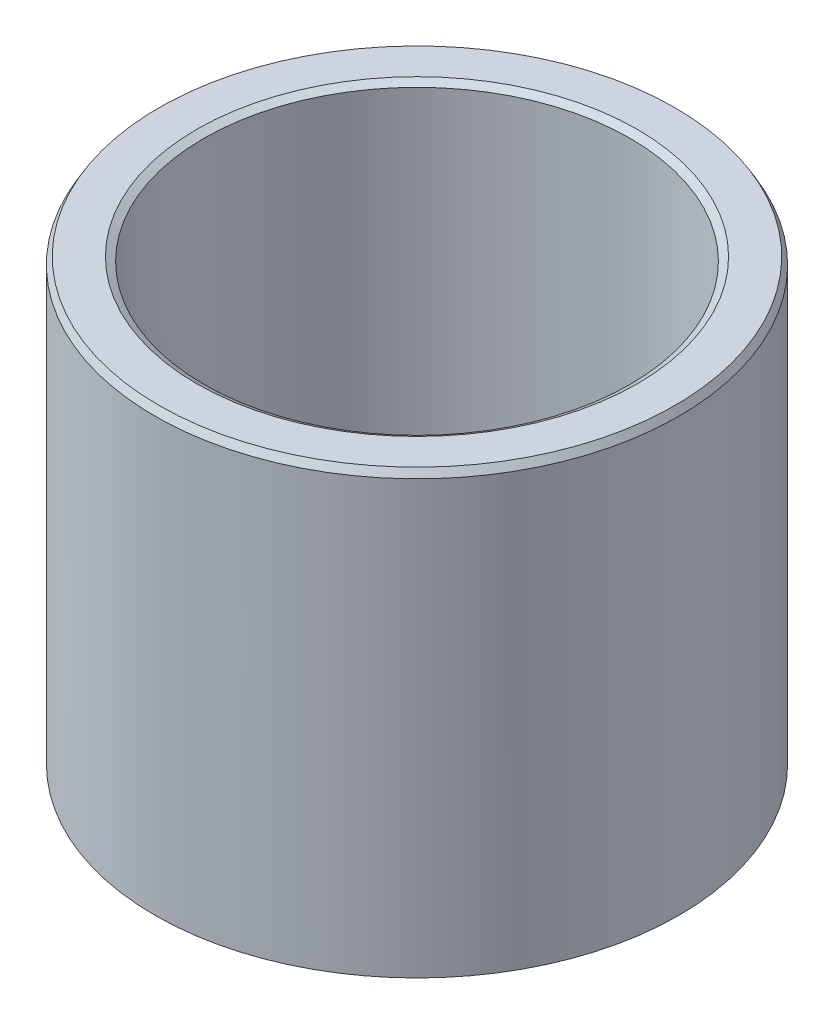
ISO-10303-21;
HEADER;
FILE_DESCRIPTION(('STEP AP214'),'2;1');
FILE_NAME('part.step','',(''),(''),'','','');
FILE_SCHEMA(('AUTOMOTIVE_DESIGN { 1 0 10303 214 1 1 1 1 }'));
ENDSEC;
DATA;
#1=APPLICATION_CONTEXT('core data for automotive mechanical design processes');
#2=APPLICATION_PROTOCOL_DEFINITION('international standard','automotive_design',2000,#1);
#3=PRODUCT_CONTEXT('',#1,'mechanical');
#4=PRODUCT('Part','Part','',(#3));
#5=PRODUCT_RELATED_PRODUCT_CATEGORY('part','',(#4));
#6=PRODUCT_DEFINITION_FORMATION('','',#4);
#7=PRODUCT_DEFINITION_CONTEXT('part definition',#1,'design');
#8=PRODUCT_DEFINITION('design','',#6,#7);
#9=PRODUCT_DEFINITION_SHAPE('','',#8);
#10=(LENGTH_UNIT() NAMED_UNIT(*) SI_UNIT(.MILLI.,.METRE.));
#11=(NAMED_UNIT(*) PLANE_ANGLE_UNIT() SI_UNIT($,.RADIAN.));
#12=(NAMED_UNIT(*) SI_UNIT($,.STERADIAN.) SOLID_ANGLE_UNIT());
#13=UNCERTAINTY_MEASURE_WITH_UNIT(LENGTH_MEASURE(1.E-05),#10,'distance_accuracy_value','');
#14=(GEOMETRIC_REPRESENTATION_CONTEXT(3) GLOBAL_UNCERTAINTY_ASSIGNED_CONTEXT((#13)) GLOBAL_UNIT_ASSIGNED_CONTEXT((#10,
#11,#12)) REPRESENTATION_CONTEXT('',''));
#15=CARTESIAN_POINT('',(0.,0.,0.));
#16=DIRECTION('',(0.,0.,1.));
#17=DIRECTION('',(1.,0.,0.));
#18=AXIS2_PLACEMENT_3D('',#15,#16,#17);
#19=CARTESIAN_POINT('',(0.,80.4044867782708,0.));
#20=DIRECTION('',(0.,-1.,0.));
#21=DIRECTION('',(0.,0.,-1.));
#22=AXIS2_PLACEMENT_3D('',#19,#20,#21);
#23=CYLINDRICAL_SURFACE('',#22,47.5);
#24=CARTESIAN_POINT('',(0.,0.75148359502214,0.));
#25=DIRECTION('',(0.,1.,0.));
#26=DIRECTION('',(0.,0.,1.));
#27=AXIS2_PLACEMENT_3D('',#24,#25,#26);
#28=CIRCLE('',#27,47.5);
#29=CARTESIAN_POINT('',(0.,0.75148359502214,-47.5));
#30=VERTEX_POINT('',#29);
#31=EDGE_CURVE('E10',#30,#30,#28,.T.);
#32=CARTESIAN_POINT('',(0.,79.1028790106383,0.));
#33=DIRECTION('',(0.,1.,0.));
#34=DIRECTION('',(0.,0.,1.));
#35=AXIS2_PLACEMENT_3D('',#32,#33,#34);
#36=CIRCLE('',#35,47.5);
#37=CARTESIAN_POINT('',(0.,79.1028790106382,-47.5));
#38=VERTEX_POINT('',#37);
#39=EDGE_CURVE('E50',#38,#38,#36,.F.);
#40=CARTESIAN_POINT('',(0.,0.75148359502214,-47.5));
#41=CARTESIAN_POINT('',(0.,1.56764396393481,-47.5));
#42=CARTESIAN_POINT('',(0.,2.38380433284748,-47.5));
#43=CARTESIAN_POINT('',(0.,4.01612507067281,-47.5));
#44=CARTESIAN_POINT('',(0.,4.83228543958548,-47.5));
#45=CARTESIAN_POINT('',(0.,6.46460617741082,-47.5));
#46=CARTESIAN_POINT('',(0.,7.28076654632348,-47.5));
#47=CARTESIAN_POINT('',(0.,8.91308728414882,-47.5));
#48=CARTESIAN_POINT('',(0.,9.72924765306148,-47.5));
#49=CARTESIAN_POINT('',(0.,11.3615683908868,-47.5));
#50=CARTESIAN_POINT('',(0.,12.1777287597995,-47.5));
#51=CARTESIAN_POINT('',(0.,13.8100494976248,-47.5));
#52=CARTESIAN_POINT('',(0.,14.6262098665375,-47.5));
#53=CARTESIAN_POINT('',(0.,16.2585306043628,-47.5));
#54=CARTESIAN_POINT('',(0.,17.0746909732755,-47.5));
#55=CARTESIAN_POINT('',(0.,18.7070117111008,-47.5));
#56=CARTESIAN_POINT('',(0.,19.5231720800135,-47.5));
#57=CARTESIAN_POINT('',(0.,21.1554928178388,-47.5));
#58=CARTESIAN_POINT('',(0.,21.9716531867515,-47.5));
#59=CARTESIAN_POINT('',(0.,23.6039739245768,-47.5));
#60=CARTESIAN_POINT('',(0.,24.4201342934895,-47.5));
#61=CARTESIAN_POINT('',(0.,26.0524550313148,-47.5));
#62=CARTESIAN_POINT('',(0.,26.8686154002275,-47.5));
#63=CARTESIAN_POINT('',(0.,28.5009361380528,-47.5));
#64=CARTESIAN_POINT('',(0.,29.3170965069655,-47.5));
#65=CARTESIAN_POINT('',(0.,30.9494172447908,-47.5));
#66=CARTESIAN_POINT('',(0.,31.7655776137035,-47.5));
#67=CARTESIAN_POINT('',(0.,33.3978983515289,-47.5));
#68=CARTESIAN_POINT('',(0.,34.2140587204415,-47.5));
#69=CARTESIAN_POINT('',(0.,35.8463794582669,-47.5));
#70=CARTESIAN_POINT('',(0.,36.6625398271795,-47.5));
#71=CARTESIAN_POINT('',(0.,38.2948605650049,-47.5));
#72=CARTESIAN_POINT('',(0.,39.1110209339175,-47.5));
#73=CARTESIAN_POINT('',(0.,40.7433416717429,-47.5));
#74=CARTESIAN_POINT('',(0.,41.5595020406555,-47.5));
#75=CARTESIAN_POINT('',(0.,43.1918227784809,-47.5));
#76=CARTESIAN_POINT('',(0.,44.0079831473935,-47.5));
#77=CARTESIAN_POINT('',(0.,45.6403038852189,-47.5));
#78=CARTESIAN_POINT('',(0.,46.4564642541315,-47.5));
#79=CARTESIAN_POINT('',(0.,48.0887849919569,-47.5));
#80=CARTESIAN_POINT('',(0.,48.9049453608695,-47.5));
#81=CARTESIAN_POINT('',(0.,50.5372660986949,-47.5));
#82=CARTESIAN_POINT('',(0.,51.3534264676075,-47.5));
#83=CARTESIAN_POINT('',(0.,52.9857472054329,-47.5));
#84=CARTESIAN_POINT('',(0.,53.8019075743455,-47.5));
#85=CARTESIAN_POINT('',(0.,55.4342283121709,-47.5));
#86=CARTESIAN_POINT('',(0.,56.2503886810835,-47.5));
#87=CARTESIAN_POINT('',(0.,57.8827094189089,-47.5));
#88=CARTESIAN_POINT('',(0.,58.6988697878216,-47.5));
#89=CARTESIAN_POINT('',(0.,60.3311905256469,-47.5));
#90=CARTESIAN_POINT('',(0.,61.1473508945595,-47.5));
#91=CARTESIAN_POINT('',(0.,62.7796716323849,-47.5));
#92=CARTESIAN_POINT('',(0.,63.5958320012976,-47.5));
#93=CARTESIAN_POINT('',(0.,65.2281527391229,-47.5));
#94=CARTESIAN_POINT('',(0.,66.0443131080356,-47.5));
#95=CARTESIAN_POINT('',(0.,67.6766338458609,-47.5));
#96=CARTESIAN_POINT('',(0.,68.4927942147736,-47.5));
#97=CARTESIAN_POINT('',(0.,70.1251149525989,-47.5));
#98=CARTESIAN_POINT('',(0.,70.9412753215116,-47.5));
#99=CARTESIAN_POINT('',(0.,72.5735960593369,-47.5));
#100=CARTESIAN_POINT('',(0.,73.3897564282496,-47.5));
#101=CARTESIAN_POINT('',(0.,75.0220771660749,-47.5));
#102=CARTESIAN_POINT('',(0.,75.8382375349876,-47.5));
#103=CARTESIAN_POINT('',(0.,77.4705582728129,-47.5));
#104=CARTESIAN_POINT('',(0.,78.2867186417256,-47.5));
#105=CARTESIAN_POINT('',(0.,79.1028790106382,-47.5));
#106=B_SPLINE_CURVE_WITH_KNOTS('',3,(#40,#41,#42,#43,#44,#45,#46,#47,#48,#49,#50,#51,#52,#53,
#54,#55,#56,#57,#58,#59,#60,#61,#62,#63,#64,#65,#66,#67,#68,#69,#70,#71,#72,#73,#74,#75,#76,#77,
#78,#79,#80,#81,#82,#83,#84,#85,#86,#87,#88,#89,#90,#91,#92,#93,#94,#95,#96,#97,#98,#99,#100,
#101,#102,#103,#104,#105),.UNSPECIFIED.,.F.,.F.,(4,2,2,2,2,2,2,2,2,2,2,2,2,2,2,2,2,2,2,2,2,2,2,
2,2,2,2,2,2,2,2,2,4),(0.,2.44848110673801,4.89696221347601,7.34544332021401,9.79392442695201,
12.24240553369,14.690886640428,17.139367747166,19.587848853904,22.036329960642,24.48481106738,
26.933292174118,29.381773280856,31.830254387594,34.278735494332,36.72721660107,39.175697707808,
41.6241788145461,44.0726599212841,46.5211410280221,48.9696221347601,51.4181032414981,
53.8665843482361,56.3150654549741,58.7635465617121,61.2120276684501,63.6605087751881,
66.1089898819261,68.5574709886641,71.0059520954021,73.4544332021401,75.9029143088781,
78.3513954156161),.UNSPECIFIED.);
#107=EDGE_CURVE('BSEAM39',#30,#38,#106,.T.);
#108=ORIENTED_EDGE('',*,*,#31,.T.);
#109=ORIENTED_EDGE('',*,*,#39,.T.);
#110=ORIENTED_EDGE('',*,*,#107,.T.);
#111=ORIENTED_EDGE('',*,*,#107,.F.);
#112=EDGE_LOOP('',(#108,#110,#109,#111));
#113=FACE_BOUND('',#112,.T.);
#114=ADVANCED_FACE('F39',(#113),#23,.T.);
#115=CARTESIAN_POINT('',(0.,80.4044867782708,0.));
#116=DIRECTION('',(0.,1.,0.));
#117=DIRECTION('',(0.,0.,1.));
#118=AXIS2_PLACEMENT_3D('',#115,#116,#117);
#119=PLANE('',#118);
#120=CARTESIAN_POINT('',(0.,80.4044867782708,0.));
#121=DIRECTION('',(0.,1.,0.));
#122=DIRECTION('',(0.,0.,1.));
#123=AXIS2_PLACEMENT_3D('',#120,#121,#122);
#124=CIRCLE('',#123,39.9333684275766);
#125=CARTESIAN_POINT('',(0.,80.4044867782708,39.9333684275766));
#126=VERTEX_POINT('',#125);
#127=EDGE_CURVE('E58',#126,#126,#124,.F.);
#128=ORIENTED_EDGE('',*,*,#127,.T.);
#129=EDGE_LOOP('',(#128));
#130=FACE_BOUND('',#129,.T.);
#131=CARTESIAN_POINT('',(0.,80.4044867782708,0.));
#132=DIRECTION('',(0.,1.,0.));
#133=DIRECTION('',(0.,0.,1.));
#134=AXIS2_PLACEMENT_3D('',#131,#132,#133);
#135=CIRCLE('',#134,46.7485164049781);
#136=CARTESIAN_POINT('',(0.,80.4044867782708,46.7485164049781));
#137=VERTEX_POINT('',#136);
#138=EDGE_CURVE('E61',#137,#137,#135,.T.);
#139=ORIENTED_EDGE('',*,*,#138,.T.);
#140=EDGE_LOOP('',(#139));
#141=FACE_BOUND('',#140,.T.);
#142=ADVANCED_FACE('F88',(#130,#141),#119,.T.);
#143=CARTESIAN_POINT('',(0.,0.,0.));
#144=DIRECTION('',(0.,1.,0.));
#145=DIRECTION('',(0.,0.,1.));
#146=AXIS2_PLACEMENT_3D('',#143,#144,#145);
#147=PLANE('',#146);
#148=CARTESIAN_POINT('',(0.,0.,0.));
#149=DIRECTION('',(0.,1.,0.));
#150=DIRECTION('',(0.,0.,1.));
#151=AXIS2_PLACEMENT_3D('',#148,#149,#150);
#152=CIRCLE('',#151,39.3832442549659);
#153=CARTESIAN_POINT('',(0.,0.,-39.3832442549659));
#154=VERTEX_POINT('',#153);
#155=EDGE_CURVE('E51',#154,#154,#152,.T.);
#156=ORIENTED_EDGE('',*,*,#155,.T.);
#157=EDGE_LOOP('',(#156));
#158=FACE_BOUND('',#157,.T.);
#159=CARTESIAN_POINT('',(0.,0.,0.));
#160=DIRECTION('',(0.,1.,0.));
#161=DIRECTION('',(0.,0.,1.));
#162=AXIS2_PLACEMENT_3D('',#159,#160,#161);
#163=CIRCLE('',#162,46.1983922323672);
#164=CARTESIAN_POINT('',(0.,0.,46.1983922323672));
#165=VERTEX_POINT('',#164);
#166=EDGE_CURVE('E54',#165,#165,#163,.F.);
#167=ORIENTED_EDGE('',*,*,#166,.T.);
#168=EDGE_LOOP('',(#167));
#169=FACE_BOUND('',#168,.T.);
#170=ADVANCED_FACE('F83',(#158,#169),#147,.F.);
#171=CARTESIAN_POINT('',(0.,80.4044867782708,0.));
#172=DIRECTION('',(0.,-1.,0.));
#173=DIRECTION('',(0.,0.,-1.));
#174=AXIS2_PLACEMENT_3D('',#171,#172,#173);
#175=CYLINDRICAL_SURFACE('',#174,38.6317606599438);
#176=CARTESIAN_POINT('',(0.,79.6530031832487,0.));
#177=DIRECTION('',(0.,1.,0.));
#178=DIRECTION('',(0.,0.,1.));
#179=AXIS2_PLACEMENT_3D('',#176,#177,#178);
#180=CIRCLE('',#179,38.6317606599438);
#181=CARTESIAN_POINT('',(0.,79.6530031832487,-38.6317606599438));
#182=VERTEX_POINT('',#181);
#183=EDGE_CURVE('E67',#182,#182,#180,.T.);
#184=CARTESIAN_POINT('',(0.,1.30160776763275,0.));
#185=DIRECTION('',(0.,1.,0.));
#186=DIRECTION('',(0.,0.,1.));
#187=AXIS2_PLACEMENT_3D('',#184,#185,#186);
#188=CIRCLE('',#187,38.6317606599438);
#189=CARTESIAN_POINT('',(0.,1.30160776763275,-38.6317606599438));
#190=VERTEX_POINT('',#189);
#191=EDGE_CURVE('E69',#190,#190,#188,.F.);
#192=CARTESIAN_POINT('',(0.,79.6530031832487,-38.6317606599438));
#193=CARTESIAN_POINT('',(0.,78.836842814336,-38.6317606599438));
#194=CARTESIAN_POINT('',(0.,78.0206824454233,-38.6317606599438));
#195=CARTESIAN_POINT('',(0.,76.388361707598,-38.6317606599438));
#196=CARTESIAN_POINT('',(0.,75.5722013386853,-38.6317606599438));
#197=CARTESIAN_POINT('',(0.,73.93988060086,-38.6317606599438));
#198=CARTESIAN_POINT('',(0.,73.1237202319473,-38.6317606599438));
#199=CARTESIAN_POINT('',(0.,71.491399494122,-38.6317606599438));
#200=CARTESIAN_POINT('',(0.,70.6752391252093,-38.6317606599438));
#201=CARTESIAN_POINT('',(0.,69.042918387384,-38.6317606599438));
#202=CARTESIAN_POINT('',(0.,68.2267580184713,-38.6317606599438));
#203=CARTESIAN_POINT('',(0.,66.594437280646,-38.6317606599438));
#204=CARTESIAN_POINT('',(0.,65.7782769117333,-38.6317606599438));
#205=CARTESIAN_POINT('',(0.,64.145956173908,-38.6317606599438));
#206=CARTESIAN_POINT('',(0.,63.3297958049953,-38.6317606599438));
#207=CARTESIAN_POINT('',(0.,61.69747506717,-38.6317606599438));
#208=CARTESIAN_POINT('',(0.,60.8813146982574,-38.6317606599438));
#209=CARTESIAN_POINT('',(0.,59.248993960432,-38.6317606599438));
#210=CARTESIAN_POINT('',(0.,58.4328335915194,-38.6317606599438));
#211=CARTESIAN_POINT('',(0.,56.800512853694,-38.6317606599438));
#212=CARTESIAN_POINT('',(0.,55.9843524847814,-38.6317606599438));
#213=CARTESIAN_POINT('',(0.,54.352031746956,-38.6317606599438));
#214=CARTESIAN_POINT('',(0.,53.5358713780434,-38.6317606599438));
#215=CARTESIAN_POINT('',(0.,51.903550640218,-38.6317606599438));
#216=CARTESIAN_POINT('',(0.,51.0873902713054,-38.6317606599438));
#217=CARTESIAN_POINT('',(0.,49.45506953348,-38.6317606599438));
#218=CARTESIAN_POINT('',(0.,48.6389091645674,-38.6317606599438));
#219=CARTESIAN_POINT('',(0.,47.006588426742,-38.6317606599438));
#220=CARTESIAN_POINT('',(0.,46.1904280578294,-38.6317606599438));
#221=CARTESIAN_POINT('',(0.,44.558107320004,-38.6317606599438));
#222=CARTESIAN_POINT('',(0.,43.7419469510914,-38.6317606599438));
#223=CARTESIAN_POINT('',(0.,42.109626213266,-38.6317606599438));
#224=CARTESIAN_POINT('',(0.,41.2934658443534,-38.6317606599438));
#225=CARTESIAN_POINT('',(0.,39.661145106528,-38.6317606599438));
#226=CARTESIAN_POINT('',(0.,38.8449847376154,-38.6317606599438));
#227=CARTESIAN_POINT('',(0.,37.21266399979,-38.6317606599438));
#228=CARTESIAN_POINT('',(0.,36.3965036308774,-38.6317606599438));
#229=CARTESIAN_POINT('',(0.,34.764182893052,-38.6317606599438));
#230=CARTESIAN_POINT('',(0.,33.9480225241394,-38.6317606599438));
#231=CARTESIAN_POINT('',(0.,32.315701786314,-38.6317606599438));
#232=CARTESIAN_POINT('',(0.,31.4995414174014,-38.6317606599438));
#233=CARTESIAN_POINT('',(0.,29.8672206795761,-38.6317606599438));
#234=CARTESIAN_POINT('',(0.,29.0510603106634,-38.6317606599438));
#235=CARTESIAN_POINT('',(0.,27.4187395728381,-38.6317606599438));
#236=CARTESIAN_POINT('',(0.,26.6025792039254,-38.6317606599438));
#237=CARTESIAN_POINT('',(0.,24.9702584661001,-38.6317606599438));
#238=CARTESIAN_POINT('',(0.,24.1540980971874,-38.6317606599438));
#239=CARTESIAN_POINT('',(0.,22.5217773593621,-38.6317606599438));
#240=CARTESIAN_POINT('',(0.,21.7056169904494,-38.6317606599438));
#241=CARTESIAN_POINT('',(0.,20.0732962526241,-38.6317606599438));
#242=CARTESIAN_POINT('',(0.,19.2571358837114,-38.6317606599438));
#243=CARTESIAN_POINT('',(0.,17.6248151458861,-38.6317606599438));
#244=CARTESIAN_POINT('',(0.,16.8086547769734,-38.6317606599438));
#245=CARTESIAN_POINT('',(0.,15.1763340391481,-38.6317606599438));
#246=CARTESIAN_POINT('',(0.,14.3601736702354,-38.6317606599438));
#247=CARTESIAN_POINT('',(0.,12.7278529324101,-38.6317606599438));
#248=CARTESIAN_POINT('',(0.,11.9116925634974,-38.6317606599438));
#249=CARTESIAN_POINT('',(0.,10.2793718256721,-38.6317606599438));
#250=CARTESIAN_POINT('',(0.,9.4632114567594,-38.6317606599438));
#251=CARTESIAN_POINT('',(0.,7.83089071893407,-38.6317606599438));
#252=CARTESIAN_POINT('',(0.,7.0147303500214,-38.6317606599438));
#253=CARTESIAN_POINT('',(0.,5.38240961219607,-38.6317606599438));
#254=CARTESIAN_POINT('',(0.,4.56624924328341,-38.6317606599438));
#255=CARTESIAN_POINT('',(0.,2.93392850545808,-38.6317606599438));
#256=CARTESIAN_POINT('',(0.,2.11776813654541,-38.6317606599438));
#257=CARTESIAN_POINT('',(0.,1.30160776763275,-38.6317606599438));
#258=B_SPLINE_CURVE_WITH_KNOTS('',3,(#192,#193,#194,#195,#196,#197,#198,#199,#200,#201,#202,
#203,#204,#205,#206,#207,#208,#209,#210,#211,#212,#213,#214,#215,#216,#217,#218,#219,#220,#221,
#222,#223,#224,#225,#226,#227,#228,#229,#230,#231,#232,#233,#234,#235,#236,#237,#238,#239,#240,
#241,#242,#243,#244,#245,#246,#247,#248,#249,#250,#251,#252,#253,#254,#255,#256,#257),
.UNSPECIFIED.,.F.,.F.,(4,2,2,2,2,2,2,2,2,2,2,2,2,2,2,2,2,2,2,2,2,2,2,2,2,2,2,2,2,2,2,2,4),(0.,
2.448481106738,4.89696221347599,7.34544332021399,9.79392442695198,12.24240553369,
14.690886640428,17.139367747166,19.587848853904,22.036329960642,24.48481106738,26.933292174118,
29.381773280856,31.830254387594,34.278735494332,36.7272166010699,39.1756977078079,
41.6241788145459,44.0726599212839,46.5211410280219,48.9696221347599,51.4181032414979,
53.8665843482359,56.3150654549739,58.7635465617119,61.2120276684499,63.6605087751879,
66.1089898819259,68.5574709886639,71.0059520954019,73.4544332021399,75.9029143088779,
78.3513954156159),.UNSPECIFIED.);
#259=EDGE_CURVE('BSEAM71',#182,#190,#258,.T.);
#260=ORIENTED_EDGE('',*,*,#183,.T.);
#261=ORIENTED_EDGE('',*,*,#191,.T.);
#262=ORIENTED_EDGE('',*,*,#259,.T.);
#263=ORIENTED_EDGE('',*,*,#259,.F.);
#264=EDGE_LOOP('',(#260,#262,#261,#263));
#265=FACE_BOUND('',#264,.T.);
#266=ADVANCED_FACE('F71',(#265),#175,.F.);
#267=CARTESIAN_POINT('',(0.,79.6530031832487,0.));
#268=DIRECTION('',(0.,1.,0.));
#269=DIRECTION('',(0.,0.,1.));
#270=AXIS2_PLACEMENT_3D('',#267,#268,#269);
#271=CONICAL_SURFACE('',#270,38.6317606599438,1.04719755119659);
#272=ORIENTED_EDGE('',*,*,#127,.F.);
#273=EDGE_LOOP('',(#272));
#274=FACE_BOUND('',#273,.T.);
#275=ORIENTED_EDGE('',*,*,#183,.F.);
#276=EDGE_LOOP('',(#275));
#277=FACE_BOUND('',#276,.T.);
#278=ADVANCED_FACE('F77',(#274,#277),#271,.F.);
#279=CARTESIAN_POINT('',(0.,0.,0.));
#280=DIRECTION('',(0.,-1.,0.));
#281=DIRECTION('',(0.,0.,-1.));
#282=AXIS2_PLACEMENT_3D('',#279,#280,#281);
#283=CONICAL_SURFACE('',#282,39.3832442549659,0.523598775598298);
#284=CARTESIAN_POINT('',(0.,1.30160776763275,-38.6317606599438));
#285=CARTESIAN_POINT('',(0.,1.28804935338657,-38.6395886140586));
#286=CARTESIAN_POINT('',(0.,1.2744909391404,-38.6474165681734));
#287=CARTESIAN_POINT('',(0.,1.24737411064805,-38.6630724764031));
#288=CARTESIAN_POINT('',(0.,1.23381569640187,-38.6709004305179));
#289=CARTESIAN_POINT('',(0.,1.20669886790952,-38.6865563387475));
#290=CARTESIAN_POINT('',(0.,1.19314045366335,-38.6943842928623));
#291=CARTESIAN_POINT('',(0.,1.166023625171,-38.7100402010919));
#292=CARTESIAN_POINT('',(0.,1.15246521092483,-38.7178681552067));
#293=CARTESIAN_POINT('',(0.,1.12534838243248,-38.7335240634364));
#294=CARTESIAN_POINT('',(0.,1.1117899681863,-38.7413520175512));
#295=CARTESIAN_POINT('',(0.,1.08467313969395,-38.7570079257808));
#296=CARTESIAN_POINT('',(0.,1.07111472544778,-38.7648358798956));
#297=CARTESIAN_POINT('',(0.,1.04399789695543,-38.7804917881253));
#298=CARTESIAN_POINT('',(0.,1.03043948270926,-38.7883197422401));
#299=CARTESIAN_POINT('',(0.,1.00332265421691,-38.8039756504697));
#300=CARTESIAN_POINT('',(0.,0.989764239970732,-38.8118036045845));
#301=CARTESIAN_POINT('',(0.,0.962647411478384,-38.8274595128141));
#302=CARTESIAN_POINT('',(0.,0.949088997232211,-38.8352874669289));
#303=CARTESIAN_POINT('',(0.,0.921972168739862,-38.8509433751586));
#304=CARTESIAN_POINT('',(0.,0.908413754493686,-38.8587713292734));
#305=CARTESIAN_POINT('',(0.,0.881296926001337,-38.874427237503));
#306=CARTESIAN_POINT('',(0.,0.867738511755164,-38.8822551916178));
#307=CARTESIAN_POINT('',(0.,0.840621683262815,-38.8979110998474));
#308=CARTESIAN_POINT('',(0.,0.82706326901664,-38.9057390539623));
#309=CARTESIAN_POINT('',(0.,0.799946440524291,-38.9213949621919));
#310=CARTESIAN_POINT('',(0.,0.786388026278117,-38.9292229163067));
#311=CARTESIAN_POINT('',(0.,0.759271197785769,-38.9448788245363));
#312=CARTESIAN_POINT('',(0.,0.745712783539594,-38.9527067786511));
#313=CARTESIAN_POINT('',(0.,0.718595955047244,-38.9683626868808));
#314=CARTESIAN_POINT('',(0.,0.70503754080107,-38.9761906409956));
#315=CARTESIAN_POINT('',(0.,0.677920712308721,-38.9918465492252));
#316=CARTESIAN_POINT('',(0.,0.664362298062548,-38.99967450334));
#317=CARTESIAN_POINT('',(0.,0.637245469570199,-39.0153304115696));
#318=CARTESIAN_POINT('',(0.,0.623687055324023,-39.0231583656845));
#319=CARTESIAN_POINT('',(0.,0.596570226831674,-39.0388142739141));
#320=CARTESIAN_POINT('',(0.,0.583011812585501,-39.0466422280289));
#321=CARTESIAN_POINT('',(0.,0.555894984093152,-39.0622981362585));
#322=CARTESIAN_POINT('',(0.,0.542336569846977,-39.0701260903733));
#323=CARTESIAN_POINT('',(0.,0.515219741354628,-39.085781998603));
#324=CARTESIAN_POINT('',(0.,0.501661327108454,-39.0936099527178));
#325=CARTESIAN_POINT('',(0.,0.474544498616106,-39.1092658609474));
#326=CARTESIAN_POINT('',(0.,0.46098608436993,-39.1170938150622));
#327=CARTESIAN_POINT('',(0.,0.433869255877581,-39.1327497232919));
#328=CARTESIAN_POINT('',(0.,0.420310841631408,-39.1405776774067));
#329=CARTESIAN_POINT('',(0.,0.393194013139059,-39.1562335856363));
#330=CARTESIAN_POINT('',(0.,0.379635598892884,-39.1640615397511));
#331=CARTESIAN_POINT('',(0.,0.352518770400535,-39.1797174479807));
#332=CARTESIAN_POINT('',(0.,0.33896035615436,-39.1875454020955));
#333=CARTESIAN_POINT('',(0.,0.311843527662012,-39.2032013103252));
#334=CARTESIAN_POINT('',(0.,0.298285113415838,-39.21102926444));
#335=CARTESIAN_POINT('',(0.,0.271168284923489,-39.2266851726696));
#336=CARTESIAN_POINT('',(0.,0.257609870677314,-39.2345131267844));
#337=CARTESIAN_POINT('',(0.,0.230493042184965,-39.250169035014));
#338=CARTESIAN_POINT('',(0.,0.216934627938791,-39.2579969891289));
#339=CARTESIAN_POINT('',(0.,0.189817799446443,-39.2736528973585));
#340=CARTESIAN_POINT('',(0.,0.176259385200267,-39.2814808514733));
#341=CARTESIAN_POINT('',(0.,0.149142556707918,-39.2971367597029));
#342=CARTESIAN_POINT('',(0.,0.135584142461745,-39.3049647138177));
#343=CARTESIAN_POINT('',(0.,0.108467313969396,-39.3206206220474));
#344=CARTESIAN_POINT('',(0.,0.0949088997232207,-39.3284485761622));
#345=CARTESIAN_POINT('',(0.,0.0677920712308715,-39.3441044843918));
#346=CARTESIAN_POINT('',(0.,0.0542336569846976,-39.3519324385066));
#347=CARTESIAN_POINT('',(0.,0.0271168284923499,-39.3675883467363));
#348=CARTESIAN_POINT('',(0.,0.0135584142461761,-39.3754163008511));
#349=CARTESIAN_POINT('',(0.,0.,-39.3832442549659));
#350=B_SPLINE_CURVE_WITH_KNOTS('',3,(#284,#285,#286,#287,#288,#289,#290,#291,#292,#293,#294,
#295,#296,#297,#298,#299,#300,#301,#302,#303,#304,#305,#306,#307,#308,#309,#310,#311,#312,#313,
#314,#315,#316,#317,#318,#319,#320,#321,#322,#323,#324,#325,#326,#327,#328,#329,#330,#331,#332,
#333,#334,#335,#336,#337,#338,#339,#340,#341,#342,#343,#344,#345,#346,#347,#348,#349),
.UNSPECIFIED.,.F.,.F.,(4,2,2,2,2,2,2,2,2,2,2,2,2,2,2,2,2,2,2,2,2,2,2,2,2,2,2,2,2,2,2,2,4),(0.,
0.046967724688878,0.0939354493777595,0.140903174066638,0.187870898755519,0.234838623444397,
0.281806348133279,0.328774072822157,0.375741797511035,0.422709522199916,0.469677246888794,
0.516644971577676,0.563612696266554,0.610580420955435,0.657548145644313,0.704515870333191,
0.751483595022073,0.798451319710951,0.845419044399832,0.89238676908871,0.939354493777591,
0.98632221846647,1.03328994315535,1.08025766784423,1.12722539253311,1.17419311722199,
1.22116084191087,1.26812856659975,1.31509629128863,1.36206401597751,1.40903174066639,
1.45599946535527,1.50296719004415),.UNSPECIFIED.);
#351=EDGE_CURVE('BSEAM73',#190,#154,#350,.T.);
#352=ORIENTED_EDGE('',*,*,#191,.F.);
#353=ORIENTED_EDGE('',*,*,#155,.F.);
#354=ORIENTED_EDGE('',*,*,#351,.T.);
#355=ORIENTED_EDGE('',*,*,#351,.F.);
#356=EDGE_LOOP('',(#352,#354,#353,#355));
#357=FACE_BOUND('',#356,.T.);
#358=ADVANCED_FACE('F73',(#357),#283,.F.);
#359=CARTESIAN_POINT('',(0.,0.751483595022126,0.));
#360=DIRECTION('',(0.,1.,0.));
#361=DIRECTION('',(0.,0.,1.));
#362=AXIS2_PLACEMENT_3D('',#359,#360,#361);
#363=CONICAL_SURFACE('',#362,47.5,1.0471975511966);
#364=ORIENTED_EDGE('',*,*,#166,.F.);
#365=EDGE_LOOP('',(#364));
#366=FACE_BOUND('',#365,.T.);
#367=ORIENTED_EDGE('',*,*,#31,.F.);
#368=EDGE_LOOP('',(#367));
#369=FACE_BOUND('',#368,.T.);
#370=ADVANCED_FACE('F76',(#366,#369),#363,.T.);
#371=CARTESIAN_POINT('',(0.,80.4044867782708,0.));
#372=DIRECTION('',(0.,-1.,0.));
#373=DIRECTION('',(0.,0.,-1.));
#374=AXIS2_PLACEMENT_3D('',#371,#372,#373);
#375=CONICAL_SURFACE('',#374,46.7485164049781,0.523598775598294);
#376=ORIENTED_EDGE('',*,*,#39,.F.);
#377=EDGE_LOOP('',(#376));
#378=FACE_BOUND('',#377,.T.);
#379=ORIENTED_EDGE('',*,*,#138,.F.);
#380=EDGE_LOOP('',(#379));
#381=FACE_BOUND('',#380,.T.);
#382=ADVANCED_FACE('F45',(#378,#381),#375,.T.);
#383=CLOSED_SHELL('',(#114,#142,#170,#266,#278,#358,#370,#382));
#384=MANIFOLD_SOLID_BREP('B2',#383);
#385=ADVANCED_BREP_SHAPE_REPRESENTATION('',(#18,#384),#14);
#386=SHAPE_DEFINITION_REPRESENTATION(#9,#385);
ENDSEC;
END-ISO-10303-21;
